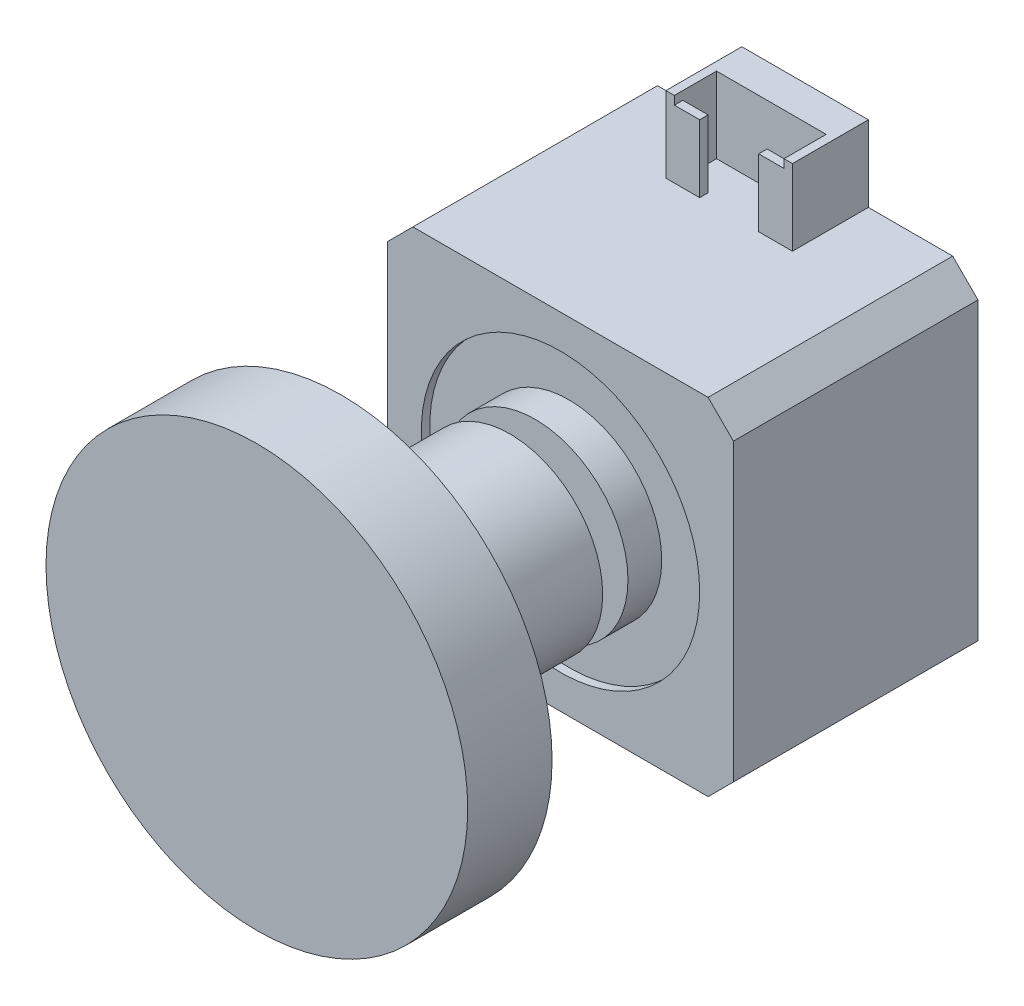
ISO-10303-21;
HEADER;
FILE_DESCRIPTION(('STEP AP214'),'2;1');
FILE_NAME('part.step','',(''),(''),'','','');
FILE_SCHEMA(('AUTOMOTIVE_DESIGN { 1 0 10303 214 1 1 1 1 }'));
ENDSEC;
DATA;
#1=APPLICATION_CONTEXT('core data for automotive mechanical design processes');
#2=APPLICATION_PROTOCOL_DEFINITION('international standard','automotive_design',2000,#1);
#3=PRODUCT_CONTEXT('',#1,'mechanical');
#4=PRODUCT('Part','Part','',(#3));
#5=PRODUCT_RELATED_PRODUCT_CATEGORY('part','',(#4));
#6=PRODUCT_DEFINITION_FORMATION('','',#4);
#7=PRODUCT_DEFINITION_CONTEXT('part definition',#1,'design');
#8=PRODUCT_DEFINITION('design','',#6,#7);
#9=PRODUCT_DEFINITION_SHAPE('','',#8);
#10=(LENGTH_UNIT() NAMED_UNIT(*) SI_UNIT(.MILLI.,.METRE.));
#11=(NAMED_UNIT(*) PLANE_ANGLE_UNIT() SI_UNIT($,.RADIAN.));
#12=(NAMED_UNIT(*) SI_UNIT($,.STERADIAN.) SOLID_ANGLE_UNIT());
#13=UNCERTAINTY_MEASURE_WITH_UNIT(LENGTH_MEASURE(1.E-05),#10,'distance_accuracy_value','');
#14=(GEOMETRIC_REPRESENTATION_CONTEXT(3) GLOBAL_UNCERTAINTY_ASSIGNED_CONTEXT((#13)) GLOBAL_UNIT_ASSIGNED_CONTEXT((#10,
#11,#12)) REPRESENTATION_CONTEXT('',''));
#15=CARTESIAN_POINT('',(0.,0.,0.));
#16=DIRECTION('',(0.,0.,1.));
#17=DIRECTION('',(1.,0.,0.));
#18=AXIS2_PLACEMENT_3D('',#15,#16,#17);
#19=CARTESIAN_POINT('',(0.,50.,0.));
#20=DIRECTION('',(0.,-1.,0.));
#21=DIRECTION('',(0.,0.,-1.));
#22=AXIS2_PLACEMENT_3D('',#19,#20,#21);
#23=PLANE('',#22);
#24=DIRECTION('',(0.,0.,-1.));
#25=VECTOR('',#24,1.);
#26=CARTESIAN_POINT('',(27.,50.,8.));
#27=LINE('',#26,#25);
#28=CARTESIAN_POINT('',(27.,50.,9.));
#29=VERTEX_POINT('',#28);
#30=CARTESIAN_POINT('',(27.,50.,4.));
#31=VERTEX_POINT('',#30);
#32=EDGE_CURVE('E218',#29,#31,#27,.T.);
#33=ORIENTED_EDGE('',*,*,#32,.F.);
#34=DIRECTION('',(1.,0.,0.));
#35=VECTOR('',#34,1.);
#36=CARTESIAN_POINT('',(28.,50.,9.));
#37=LINE('',#36,#35);
#38=CARTESIAN_POINT('',(28.,50.,9.));
#39=VERTEX_POINT('',#38);
#40=EDGE_CURVE('E222',#29,#39,#37,.T.);
#41=ORIENTED_EDGE('',*,*,#40,.T.);
#42=DIRECTION('',(0.,0.,-1.));
#43=VECTOR('',#42,1.);
#44=CARTESIAN_POINT('',(28.,50.,0.));
#45=LINE('',#44,#43);
#46=CARTESIAN_POINT('',(28.,50.,0.));
#47=VERTEX_POINT('',#46);
#48=EDGE_CURVE('E262',#39,#47,#45,.T.);
#49=ORIENTED_EDGE('',*,*,#48,.T.);
#50=DIRECTION('',(-1.,0.,0.));
#51=VECTOR('',#50,1.);
#52=CARTESIAN_POINT('',(28.,50.,0.));
#53=LINE('',#52,#51);
#54=CARTESIAN_POINT('',(13.,50.,0.));
#55=VERTEX_POINT('',#54);
#56=EDGE_CURVE('E248',#47,#55,#53,.T.);
#57=ORIENTED_EDGE('',*,*,#56,.T.);
#58=DIRECTION('',(0.,0.,1.));
#59=VECTOR('',#58,1.);
#60=CARTESIAN_POINT('',(13.,50.,0.));
#61=LINE('',#60,#59);
#62=CARTESIAN_POINT('',(13.,50.,9.));
#63=VERTEX_POINT('',#62);
#64=EDGE_CURVE('E245',#55,#63,#61,.T.);
#65=ORIENTED_EDGE('',*,*,#64,.T.);
#66=CARTESIAN_POINT('',(14.,50.,9.));
#67=VERTEX_POINT('',#66);
#68=EDGE_CURVE('E244',#63,#67,#37,.T.);
#69=ORIENTED_EDGE('',*,*,#68,.T.);
#70=DIRECTION('',(0.,0.,1.));
#71=VECTOR('',#70,1.);
#72=CARTESIAN_POINT('',(14.,50.,8.));
#73=LINE('',#72,#71);
#74=CARTESIAN_POINT('',(14.,50.,4.));
#75=VERTEX_POINT('',#74);
#76=EDGE_CURVE('E391',#75,#67,#73,.T.);
#77=ORIENTED_EDGE('',*,*,#76,.F.);
#78=DIRECTION('',(-1.,0.,0.));
#79=VECTOR('',#78,1.);
#80=CARTESIAN_POINT('',(27.,50.,4.));
#81=LINE('',#80,#79);
#82=EDGE_CURVE('E224',#31,#75,#81,.T.);
#83=ORIENTED_EDGE('',*,*,#82,.F.);
#84=EDGE_LOOP('',(#33,#41,#49,#57,#65,#69,#77,#83));
#85=FACE_BOUND('',#84,.T.);
#86=ADVANCED_FACE('F69',(#85),#23,.F.);
#87=CARTESIAN_POINT('',(28.,50.,9.));
#88=DIRECTION('',(0.,0.,-1.));
#89=DIRECTION('',(-1.,0.,0.));
#90=AXIS2_PLACEMENT_3D('',#87,#88,#89);
#91=PLANE('',#90);
#92=DIRECTION('',(0.,-1.,0.));
#93=VECTOR('',#92,1.);
#94=CARTESIAN_POINT('',(27.,0.,9.));
#95=LINE('',#94,#93);
#96=CARTESIAN_POINT('',(27.,49.,9.));
#97=VERTEX_POINT('',#96);
#98=EDGE_CURVE('E231',#29,#97,#95,.T.);
#99=ORIENTED_EDGE('',*,*,#98,.T.);
#100=DIRECTION('',(1.,0.,0.));
#101=VECTOR('',#100,1.);
#102=CARTESIAN_POINT('',(0.,49.,9.));
#103=LINE('',#102,#101);
#104=CARTESIAN_POINT('',(24.,49.,9.));
#105=VERTEX_POINT('',#104);
#106=EDGE_CURVE('E452',#105,#97,#103,.T.);
#107=ORIENTED_EDGE('',*,*,#106,.F.);
#108=DIRECTION('',(0.,1.,0.));
#109=VECTOR('',#108,1.);
#110=CARTESIAN_POINT('',(24.,0.,9.));
#111=LINE('',#110,#109);
#112=CARTESIAN_POINT('',(24.,41.,9.));
#113=VERTEX_POINT('',#112);
#114=EDGE_CURVE('E444',#113,#105,#111,.T.);
#115=ORIENTED_EDGE('',*,*,#114,.F.);
#116=DIRECTION('',(1.,0.,0.));
#117=VECTOR('',#116,1.);
#118=CARTESIAN_POINT('',(28.,41.,9.));
#119=LINE('',#118,#117);
#120=CARTESIAN_POINT('',(28.,41.,9.));
#121=VERTEX_POINT('',#120);
#122=EDGE_CURVE('E92',#113,#121,#119,.T.);
#123=ORIENTED_EDGE('',*,*,#122,.T.);
#124=DIRECTION('',(0.,-1.,0.));
#125=VECTOR('',#124,1.);
#126=CARTESIAN_POINT('',(28.,50.,9.));
#127=LINE('',#126,#125);
#128=EDGE_CURVE('E242',#39,#121,#127,.T.);
#129=ORIENTED_EDGE('',*,*,#128,.F.);
#130=ORIENTED_EDGE('',*,*,#40,.F.);
#131=EDGE_LOOP('',(#99,#107,#115,#123,#129,#130));
#132=FACE_BOUND('',#131,.T.);
#133=ADVANCED_FACE('F240',(#132),#91,.F.);
#134=DIRECTION('',(0.,1.,0.));
#135=VECTOR('',#134,1.);
#136=CARTESIAN_POINT('',(17.,0.,9.));
#137=LINE('',#136,#135);
#138=CARTESIAN_POINT('',(17.,41.,9.));
#139=VERTEX_POINT('',#138);
#140=CARTESIAN_POINT('',(17.,49.,9.));
#141=VERTEX_POINT('',#140);
#142=EDGE_CURVE('E237',#139,#141,#137,.T.);
#143=ORIENTED_EDGE('',*,*,#142,.T.);
#144=DIRECTION('',(-1.,0.,0.));
#145=VECTOR('',#144,1.);
#146=CARTESIAN_POINT('',(17.,49.,9.));
#147=LINE('',#146,#145);
#148=CARTESIAN_POINT('',(14.,49.,9.));
#149=VERTEX_POINT('',#148);
#150=EDGE_CURVE('E381',#141,#149,#147,.T.);
#151=ORIENTED_EDGE('',*,*,#150,.T.);
#152=DIRECTION('',(0.,-1.,0.));
#153=VECTOR('',#152,1.);
#154=CARTESIAN_POINT('',(14.,50.,9.));
#155=LINE('',#154,#153);
#156=EDGE_CURVE('E379',#67,#149,#155,.T.);
#157=ORIENTED_EDGE('',*,*,#156,.F.);
#158=ORIENTED_EDGE('',*,*,#68,.F.);
#159=DIRECTION('',(0.,-1.,0.));
#160=VECTOR('',#159,1.);
#161=CARTESIAN_POINT('',(13.,50.,9.));
#162=LINE('',#161,#160);
#163=CARTESIAN_POINT('',(13.,41.,9.));
#164=VERTEX_POINT('',#163);
#165=EDGE_CURVE('E264',#63,#164,#162,.T.);
#166=ORIENTED_EDGE('',*,*,#165,.T.);
#167=EDGE_CURVE('E259',#164,#139,#119,.T.);
#168=ORIENTED_EDGE('',*,*,#167,.T.);
#169=EDGE_LOOP('',(#143,#151,#157,#158,#166,#168));
#170=FACE_BOUND('',#169,.T.);
#171=ADVANCED_FACE('F422',(#170),#91,.F.);
#172=CARTESIAN_POINT('',(27.,50.,8.));
#173=DIRECTION('',(0.,0.,-1.));
#174=DIRECTION('',(-1.,0.,0.));
#175=AXIS2_PLACEMENT_3D('',#172,#173,#174);
#176=PLANE('',#175);
#177=DIRECTION('',(1.,0.,0.));
#178=VECTOR('',#177,1.);
#179=CARTESIAN_POINT('',(27.,49.,8.));
#180=LINE('',#179,#178);
#181=CARTESIAN_POINT('',(14.,49.,8.));
#182=VERTEX_POINT('',#181);
#183=CARTESIAN_POINT('',(17.,49.,8.));
#184=VERTEX_POINT('',#183);
#185=EDGE_CURVE('E77',#182,#184,#180,.T.);
#186=ORIENTED_EDGE('',*,*,#185,.T.);
#187=DIRECTION('',(0.,-1.,0.));
#188=VECTOR('',#187,1.);
#189=CARTESIAN_POINT('',(17.,50.,8.));
#190=LINE('',#189,#188);
#191=CARTESIAN_POINT('',(17.,41.,8.));
#192=VERTEX_POINT('',#191);
#193=EDGE_CURVE('E369',#184,#192,#190,.T.);
#194=ORIENTED_EDGE('',*,*,#193,.T.);
#195=DIRECTION('',(1.,0.,0.));
#196=VECTOR('',#195,1.);
#197=CARTESIAN_POINT('',(27.,41.,8.));
#198=LINE('',#197,#196);
#199=CARTESIAN_POINT('',(14.,41.,8.));
#200=VERTEX_POINT('',#199);
#201=EDGE_CURVE('E228',#200,#192,#198,.T.);
#202=ORIENTED_EDGE('',*,*,#201,.F.);
#203=DIRECTION('',(0.,-1.,0.));
#204=VECTOR('',#203,1.);
#205=CARTESIAN_POINT('',(14.,50.,8.));
#206=LINE('',#205,#204);
#207=EDGE_CURVE('E371',#182,#200,#206,.T.);
#208=ORIENTED_EDGE('',*,*,#207,.F.);
#209=EDGE_LOOP('',(#186,#194,#202,#208));
#210=FACE_BOUND('',#209,.T.);
#211=ADVANCED_FACE('F367',(#210),#176,.T.);
#212=CARTESIAN_POINT('',(0.,0.,29.));
#213=DIRECTION('',(1.,0.,0.));
#214=DIRECTION('',(0.,0.,-1.));
#215=AXIS2_PLACEMENT_3D('',#212,#213,#214);
#216=PLANE('',#215);
#217=DIRECTION('',(0.,-1.,0.));
#218=VECTOR('',#217,1.);
#219=CARTESIAN_POINT('',(0.,0.,0.));
#220=LINE('',#219,#218);
#221=CARTESIAN_POINT('',(0.,38.,0.));
#222=VERTEX_POINT('',#221);
#223=CARTESIAN_POINT('',(0.,3.00000000000002,0.));
#224=VERTEX_POINT('',#223);
#225=EDGE_CURVE('E301',#222,#224,#220,.T.);
#226=ORIENTED_EDGE('',*,*,#225,.T.);
#227=DIRECTION('',(0.,0.,1.));
#228=VECTOR('',#227,1.);
#229=CARTESIAN_POINT('',(0.,3.00000000000002,29.));
#230=LINE('',#229,#228);
#231=CARTESIAN_POINT('',(0.,3.00000000000002,29.));
#232=VERTEX_POINT('',#231);
#233=EDGE_CURVE('E362',#224,#232,#230,.T.);
#234=ORIENTED_EDGE('',*,*,#233,.T.);
#235=DIRECTION('',(0.,-1.,0.));
#236=VECTOR('',#235,1.);
#237=CARTESIAN_POINT('',(0.,0.,29.));
#238=LINE('',#237,#236);
#239=CARTESIAN_POINT('',(0.,38.,29.));
#240=VERTEX_POINT('',#239);
#241=EDGE_CURVE('E304',#240,#232,#238,.T.);
#242=ORIENTED_EDGE('',*,*,#241,.F.);
#243=DIRECTION('',(0.,0.,-1.));
#244=VECTOR('',#243,1.);
#245=CARTESIAN_POINT('',(0.,38.,29.));
#246=LINE('',#245,#244);
#247=EDGE_CURVE('E359',#240,#222,#246,.T.);
#248=ORIENTED_EDGE('',*,*,#247,.T.);
#249=EDGE_LOOP('',(#226,#234,#242,#248));
#250=FACE_BOUND('',#249,.T.);
#251=ADVANCED_FACE('F538',(#250),#216,.F.);
#252=CARTESIAN_POINT('',(0.,0.,29.));
#253=DIRECTION('',(0.,1.,0.));
#254=DIRECTION('',(0.,0.,1.));
#255=AXIS2_PLACEMENT_3D('',#252,#253,#254);
#256=PLANE('',#255);
#257=DIRECTION('',(1.,0.,0.));
#258=VECTOR('',#257,1.);
#259=CARTESIAN_POINT('',(0.,0.,0.));
#260=LINE('',#259,#258);
#261=CARTESIAN_POINT('',(3.,0.,0.));
#262=VERTEX_POINT('',#261);
#263=CARTESIAN_POINT('',(38.,0.,0.));
#264=VERTEX_POINT('',#263);
#265=EDGE_CURVE('E320',#262,#264,#260,.T.);
#266=ORIENTED_EDGE('',*,*,#265,.T.);
#267=DIRECTION('',(0.,0.,1.));
#268=VECTOR('',#267,1.);
#269=CARTESIAN_POINT('',(38.,0.,29.));
#270=LINE('',#269,#268);
#271=CARTESIAN_POINT('',(38.,0.,29.));
#272=VERTEX_POINT('',#271);
#273=EDGE_CURVE('E357',#264,#272,#270,.T.);
#274=ORIENTED_EDGE('',*,*,#273,.T.);
#275=DIRECTION('',(1.,0.,0.));
#276=VECTOR('',#275,1.);
#277=CARTESIAN_POINT('',(0.,0.,29.));
#278=LINE('',#277,#276);
#279=CARTESIAN_POINT('',(3.,0.,29.));
#280=VERTEX_POINT('',#279);
#281=EDGE_CURVE('E307',#280,#272,#278,.T.);
#282=ORIENTED_EDGE('',*,*,#281,.F.);
#283=DIRECTION('',(0.,0.,-1.));
#284=VECTOR('',#283,1.);
#285=CARTESIAN_POINT('',(3.,0.,29.));
#286=LINE('',#285,#284);
#287=EDGE_CURVE('E354',#280,#262,#286,.T.);
#288=ORIENTED_EDGE('',*,*,#287,.T.);
#289=EDGE_LOOP('',(#266,#274,#282,#288));
#290=FACE_BOUND('',#289,.T.);
#291=ADVANCED_FACE('F534',(#290),#256,.F.);
#292=CARTESIAN_POINT('',(41.,0.,29.));
#293=DIRECTION('',(-1.,0.,0.));
#294=DIRECTION('',(0.,0.,1.));
#295=AXIS2_PLACEMENT_3D('',#292,#293,#294);
#296=PLANE('',#295);
#297=DIRECTION('',(0.,1.,0.));
#298=VECTOR('',#297,1.);
#299=CARTESIAN_POINT('',(41.,0.,0.));
#300=LINE('',#299,#298);
#301=CARTESIAN_POINT('',(41.,3.,0.));
#302=VERTEX_POINT('',#301);
#303=CARTESIAN_POINT('',(41.,38.,0.));
#304=VERTEX_POINT('',#303);
#305=EDGE_CURVE('E323',#302,#304,#300,.T.);
#306=ORIENTED_EDGE('',*,*,#305,.T.);
#307=DIRECTION('',(0.,0.,1.));
#308=VECTOR('',#307,1.);
#309=CARTESIAN_POINT('',(41.,38.,29.));
#310=LINE('',#309,#308);
#311=CARTESIAN_POINT('',(41.,38.,29.));
#312=VERTEX_POINT('',#311);
#313=EDGE_CURVE('E344',#304,#312,#310,.T.);
#314=ORIENTED_EDGE('',*,*,#313,.T.);
#315=DIRECTION('',(0.,1.,0.));
#316=VECTOR('',#315,1.);
#317=CARTESIAN_POINT('',(41.,0.,29.));
#318=LINE('',#317,#316);
#319=CARTESIAN_POINT('',(41.,3.,29.));
#320=VERTEX_POINT('',#319);
#321=EDGE_CURVE('E311',#320,#312,#318,.T.);
#322=ORIENTED_EDGE('',*,*,#321,.F.);
#323=DIRECTION('',(0.,0.,-1.));
#324=VECTOR('',#323,1.);
#325=CARTESIAN_POINT('',(41.,3.,29.));
#326=LINE('',#325,#324);
#327=EDGE_CURVE('E341',#320,#302,#326,.T.);
#328=ORIENTED_EDGE('',*,*,#327,.T.);
#329=EDGE_LOOP('',(#306,#314,#322,#328));
#330=FACE_BOUND('',#329,.T.);
#331=ADVANCED_FACE('F528',(#330),#296,.F.);
#332=CARTESIAN_POINT('',(0.,0.,29.));
#333=DIRECTION('',(0.,0.,-1.));
#334=DIRECTION('',(-1.,0.,0.));
#335=AXIS2_PLACEMENT_3D('',#332,#333,#334);
#336=PLANE('',#335);
#337=CARTESIAN_POINT('',(20.5,20.5,29.));
#338=DIRECTION('',(0.,0.,1.));
#339=DIRECTION('',(1.,0.,0.));
#340=AXIS2_PLACEMENT_3D('',#337,#338,#339);
#341=CIRCLE('',#340,16.5);
#342=CARTESIAN_POINT('',(37.,20.5,29.));
#343=VERTEX_POINT('',#342);
#344=EDGE_CURVE('E294',#343,#343,#341,.T.);
#345=ORIENTED_EDGE('',*,*,#344,.F.);
#346=EDGE_LOOP('',(#345));
#347=FACE_BOUND('',#346,.T.);
#348=ORIENTED_EDGE('',*,*,#321,.T.);
#349=DIRECTION('',(0.707106781186544,-0.707106781186551,0.));
#350=VECTOR('',#349,1.);
#351=CARTESIAN_POINT('',(38.,41.,29.));
#352=LINE('',#351,#350);
#353=CARTESIAN_POINT('',(38.,41.,29.));
#354=VERTEX_POINT('',#353);
#355=EDGE_CURVE('E352',#312,#354,#352,.F.);
#356=ORIENTED_EDGE('',*,*,#355,.T.);
#357=DIRECTION('',(-1.,0.,0.));
#358=VECTOR('',#357,1.);
#359=CARTESIAN_POINT('',(0.,41.,29.));
#360=LINE('',#359,#358);
#361=CARTESIAN_POINT('',(3.00000000000003,41.,29.));
#362=VERTEX_POINT('',#361);
#363=EDGE_CURVE('E314',#354,#362,#360,.T.);
#364=ORIENTED_EDGE('',*,*,#363,.T.);
#365=DIRECTION('',(0.70710678118655,0.707106781186545,0.));
#366=VECTOR('',#365,1.);
#367=CARTESIAN_POINT('',(0.,38.,29.));
#368=LINE('',#367,#366);
#369=EDGE_CURVE('E346',#362,#240,#368,.F.);
#370=ORIENTED_EDGE('',*,*,#369,.T.);
#371=ORIENTED_EDGE('',*,*,#241,.T.);
#372=DIRECTION('',(-0.707106781186546,0.707106781186549,0.));
#373=VECTOR('',#372,1.);
#374=CARTESIAN_POINT('',(3.,0.,29.));
#375=LINE('',#374,#373);
#376=EDGE_CURVE('E348',#232,#280,#375,.F.);
#377=ORIENTED_EDGE('',*,*,#376,.T.);
#378=ORIENTED_EDGE('',*,*,#281,.T.);
#379=DIRECTION('',(-0.70710678118655,-0.707106781186545,0.));
#380=VECTOR('',#379,1.);
#381=CARTESIAN_POINT('',(41.,3.,29.));
#382=LINE('',#381,#380);
#383=EDGE_CURVE('E350',#272,#320,#382,.F.);
#384=ORIENTED_EDGE('',*,*,#383,.T.);
#385=EDGE_LOOP('',(#348,#356,#364,#370,#371,#377,#378,#384));
#386=FACE_BOUND('',#385,.T.);
#387=ADVANCED_FACE('F525',(#347,#386),#336,.F.);
#388=CARTESIAN_POINT('',(0.,0.,0.));
#389=DIRECTION('',(0.,0.,-1.));
#390=DIRECTION('',(-1.,0.,0.));
#391=AXIS2_PLACEMENT_3D('',#388,#389,#390);
#392=PLANE('',#391);
#393=DIRECTION('',(-1.,0.,0.));
#394=VECTOR('',#393,1.);
#395=CARTESIAN_POINT('',(0.,41.,0.));
#396=LINE('',#395,#394);
#397=CARTESIAN_POINT('',(38.,41.,0.));
#398=VERTEX_POINT('',#397);
#399=CARTESIAN_POINT('',(28.,41.,0.));
#400=VERTEX_POINT('',#399);
#401=EDGE_CURVE('E308',#398,#400,#396,.T.);
#402=ORIENTED_EDGE('',*,*,#401,.F.);
#403=DIRECTION('',(-0.707106781186544,0.707106781186551,0.));
#404=VECTOR('',#403,1.);
#405=CARTESIAN_POINT('',(39.5000000000002,39.4999999999998,0.));
#406=LINE('',#405,#404);
#407=EDGE_CURVE('E339',#398,#304,#406,.F.);
#408=ORIENTED_EDGE('',*,*,#407,.T.);
#409=ORIENTED_EDGE('',*,*,#305,.F.);
#410=DIRECTION('',(0.70710678118655,0.707106781186545,0.));
#411=VECTOR('',#410,1.);
#412=CARTESIAN_POINT('',(18.9999999999998,-19.,0.));
#413=LINE('',#412,#411);
#414=EDGE_CURVE('E337',#302,#264,#413,.F.);
#415=ORIENTED_EDGE('',*,*,#414,.T.);
#416=ORIENTED_EDGE('',*,*,#265,.F.);
#417=DIRECTION('',(0.707106781186546,-0.707106781186549,0.));
#418=VECTOR('',#417,1.);
#419=CARTESIAN_POINT('',(1.50000000000001,1.5,0.));
#420=LINE('',#419,#418);
#421=EDGE_CURVE('E335',#262,#224,#420,.F.);
#422=ORIENTED_EDGE('',*,*,#421,.T.);
#423=ORIENTED_EDGE('',*,*,#225,.F.);
#424=DIRECTION('',(-0.70710678118655,-0.707106781186545,0.));
#425=VECTOR('',#424,1.);
#426=CARTESIAN_POINT('',(-19.,19.0000000000001,0.));
#427=LINE('',#426,#425);
#428=CARTESIAN_POINT('',(3.00000000000003,41.,0.));
#429=VERTEX_POINT('',#428);
#430=EDGE_CURVE('E332',#222,#429,#427,.F.);
#431=ORIENTED_EDGE('',*,*,#430,.T.);
#432=CARTESIAN_POINT('',(13.,41.,0.));
#433=VERTEX_POINT('',#432);
#434=EDGE_CURVE('E326',#433,#429,#396,.T.);
#435=ORIENTED_EDGE('',*,*,#434,.F.);
#436=DIRECTION('',(0.,-1.,0.));
#437=VECTOR('',#436,1.);
#438=CARTESIAN_POINT('',(13.,50.,0.));
#439=LINE('',#438,#437);
#440=EDGE_CURVE('E267',#55,#433,#439,.T.);
#441=ORIENTED_EDGE('',*,*,#440,.F.);
#442=ORIENTED_EDGE('',*,*,#56,.F.);
#443=DIRECTION('',(0.,-1.,0.));
#444=VECTOR('',#443,1.);
#445=CARTESIAN_POINT('',(28.,50.,0.));
#446=LINE('',#445,#444);
#447=EDGE_CURVE('E270',#47,#400,#446,.T.);
#448=ORIENTED_EDGE('',*,*,#447,.T.);
#449=EDGE_LOOP('',(#402,#408,#409,#415,#416,#422,#423,#431,#435,#441,#442,#448));
#450=FACE_BOUND('',#449,.T.);
#451=ADVANCED_FACE('F416',(#450),#392,.T.);
#452=CARTESIAN_POINT('',(20.5,20.5,28.));
#453=DIRECTION('',(0.,0.,1.));
#454=DIRECTION('',(1.,0.,0.));
#455=AXIS2_PLACEMENT_3D('',#452,#453,#454);
#456=CYLINDRICAL_SURFACE('',#455,11.);
#457=CARTESIAN_POINT('',(20.5,20.5,28.));
#458=DIRECTION('',(0.,0.,1.));
#459=DIRECTION('',(1.,0.,0.));
#460=AXIS2_PLACEMENT_3D('',#457,#458,#459);
#461=CIRCLE('',#460,11.);
#462=CARTESIAN_POINT('',(31.5,20.5,28.));
#463=VERTEX_POINT('',#462);
#464=EDGE_CURVE('E295',#463,#463,#461,.T.);
#465=ORIENTED_EDGE('',*,*,#464,.T.);
#466=EDGE_LOOP('',(#465));
#467=FACE_BOUND('',#466,.T.);
#468=CARTESIAN_POINT('',(20.5,20.5,32.));
#469=DIRECTION('',(0.,0.,1.));
#470=DIRECTION('',(1.,0.,0.));
#471=AXIS2_PLACEMENT_3D('',#468,#469,#470);
#472=CIRCLE('',#471,11.);
#473=CARTESIAN_POINT('',(31.5,20.5,32.));
#474=VERTEX_POINT('',#473);
#475=EDGE_CURVE('E291',#474,#474,#472,.T.);
#476=ORIENTED_EDGE('',*,*,#475,.F.);
#477=EDGE_LOOP('',(#476));
#478=FACE_BOUND('',#477,.T.);
#479=ADVANCED_FACE('F520',(#467,#478),#456,.T.);
#480=CARTESIAN_POINT('',(20.5,20.5,28.));
#481=DIRECTION('',(0.,0.,1.));
#482=DIRECTION('',(1.,0.,0.));
#483=AXIS2_PLACEMENT_3D('',#480,#481,#482);
#484=CYLINDRICAL_SURFACE('',#483,16.5);
#485=CARTESIAN_POINT('',(20.5,20.5,28.));
#486=DIRECTION('',(0.,0.,1.));
#487=DIRECTION('',(1.,0.,0.));
#488=AXIS2_PLACEMENT_3D('',#485,#486,#487);
#489=CIRCLE('',#488,16.5);
#490=CARTESIAN_POINT('',(37.,20.5,28.));
#491=VERTEX_POINT('',#490);
#492=EDGE_CURVE('E298',#491,#491,#489,.T.);
#493=ORIENTED_EDGE('',*,*,#492,.F.);
#494=EDGE_LOOP('',(#493));
#495=FACE_BOUND('',#494,.T.);
#496=ORIENTED_EDGE('',*,*,#344,.T.);
#497=EDGE_LOOP('',(#496));
#498=FACE_BOUND('',#497,.T.);
#499=ADVANCED_FACE('F516',(#495,#498),#484,.F.);
#500=CARTESIAN_POINT('',(0.,0.,28.));
#501=DIRECTION('',(0.,0.,1.));
#502=DIRECTION('',(1.,0.,0.));
#503=AXIS2_PLACEMENT_3D('',#500,#501,#502);
#504=PLANE('',#503);
#505=ORIENTED_EDGE('',*,*,#464,.F.);
#506=EDGE_LOOP('',(#505));
#507=FACE_BOUND('',#506,.T.);
#508=ORIENTED_EDGE('',*,*,#492,.T.);
#509=EDGE_LOOP('',(#508));
#510=FACE_BOUND('',#509,.T.);
#511=ADVANCED_FACE('F512',(#507,#510),#504,.T.);
#512=CARTESIAN_POINT('',(0.,0.,32.));
#513=DIRECTION('',(0.,0.,1.));
#514=DIRECTION('',(1.,0.,0.));
#515=AXIS2_PLACEMENT_3D('',#512,#513,#514);
#516=PLANE('',#515);
#517=CARTESIAN_POINT('',(20.5,20.5,32.));
#518=DIRECTION('',(0.,0.,1.));
#519=DIRECTION('',(1.,0.,0.));
#520=AXIS2_PLACEMENT_3D('',#517,#518,#519);
#521=CIRCLE('',#520,2.49999999999999);
#522=CARTESIAN_POINT('',(23.,20.5,32.));
#523=VERTEX_POINT('',#522);
#524=EDGE_CURVE('E288',#523,#523,#521,.T.);
#525=ORIENTED_EDGE('',*,*,#524,.F.);
#526=EDGE_LOOP('',(#525));
#527=FACE_BOUND('',#526,.T.);
#528=ORIENTED_EDGE('',*,*,#475,.T.);
#529=EDGE_LOOP('',(#528));
#530=FACE_BOUND('',#529,.T.);
#531=ADVANCED_FACE('F508',(#527,#530),#516,.T.);
#532=CARTESIAN_POINT('',(20.5,20.5,35.));
#533=DIRECTION('',(0.,0.,-1.));
#534=DIRECTION('',(-1.,0.,0.));
#535=AXIS2_PLACEMENT_3D('',#532,#533,#534);
#536=CYLINDRICAL_SURFACE('',#535,2.49999999999999);
#537=ORIENTED_EDGE('',*,*,#524,.T.);
#538=EDGE_LOOP('',(#537));
#539=FACE_BOUND('',#538,.T.);
#540=CARTESIAN_POINT('',(20.5,20.5,35.));
#541=DIRECTION('',(0.,0.,1.));
#542=DIRECTION('',(1.,0.,0.));
#543=AXIS2_PLACEMENT_3D('',#540,#541,#542);
#544=CIRCLE('',#543,2.49999999999999);
#545=CARTESIAN_POINT('',(23.,20.5,35.));
#546=VERTEX_POINT('',#545);
#547=EDGE_CURVE('E283',#546,#546,#544,.T.);
#548=ORIENTED_EDGE('',*,*,#547,.F.);
#549=EDGE_LOOP('',(#548));
#550=FACE_BOUND('',#549,.T.);
#551=ADVANCED_FACE('F504',(#539,#550),#536,.T.);
#552=CARTESIAN_POINT('',(20.5,20.5,55.));
#553=DIRECTION('',(0.,0.,-1.));
#554=DIRECTION('',(-1.,0.,0.));
#555=AXIS2_PLACEMENT_3D('',#552,#553,#554);
#556=CYLINDRICAL_SURFACE('',#555,11.);
#557=CARTESIAN_POINT('',(20.5,20.5,55.));
#558=DIRECTION('',(0.,0.,1.));
#559=DIRECTION('',(1.,0.,0.));
#560=AXIS2_PLACEMENT_3D('',#557,#558,#559);
#561=CIRCLE('',#560,11.);
#562=CARTESIAN_POINT('',(31.5,20.5,55.));
#563=VERTEX_POINT('',#562);
#564=EDGE_CURVE('E280',#563,#563,#561,.T.);
#565=ORIENTED_EDGE('',*,*,#564,.F.);
#566=EDGE_LOOP('',(#565));
#567=FACE_BOUND('',#566,.T.);
#568=CARTESIAN_POINT('',(20.5,20.5,35.));
#569=DIRECTION('',(0.,0.,1.));
#570=DIRECTION('',(1.,0.,0.));
#571=AXIS2_PLACEMENT_3D('',#568,#569,#570);
#572=CIRCLE('',#571,11.);
#573=CARTESIAN_POINT('',(31.5,20.5,35.));
#574=VERTEX_POINT('',#573);
#575=EDGE_CURVE('E277',#574,#574,#572,.T.);
#576=ORIENTED_EDGE('',*,*,#575,.T.);
#577=EDGE_LOOP('',(#576));
#578=FACE_BOUND('',#577,.T.);
#579=ADVANCED_FACE('F500',(#567,#578),#556,.T.);
#580=CARTESIAN_POINT('',(20.5,20.5,35.));
#581=DIRECTION('',(0.,0.,1.));
#582=DIRECTION('',(1.,0.,0.));
#583=AXIS2_PLACEMENT_3D('',#580,#581,#582);
#584=PLANE('',#583);
#585=ORIENTED_EDGE('',*,*,#547,.T.);
#586=EDGE_LOOP('',(#585));
#587=FACE_BOUND('',#586,.T.);
#588=ORIENTED_EDGE('',*,*,#575,.F.);
#589=EDGE_LOOP('',(#588));
#590=FACE_BOUND('',#589,.T.);
#591=ADVANCED_FACE('F496',(#587,#590),#584,.F.);
#592=CARTESIAN_POINT('',(20.5,20.5,65.));
#593=DIRECTION('',(0.,0.,-1.));
#594=DIRECTION('',(-1.,0.,0.));
#595=AXIS2_PLACEMENT_3D('',#592,#593,#594);
#596=CYLINDRICAL_SURFACE('',#595,25.);
#597=CARTESIAN_POINT('',(20.5,20.5,65.));
#598=DIRECTION('',(0.,0.,1.));
#599=DIRECTION('',(1.,0.,0.));
#600=AXIS2_PLACEMENT_3D('',#597,#598,#599);
#601=CIRCLE('',#600,25.);
#602=CARTESIAN_POINT('',(45.5,20.5,65.));
#603=VERTEX_POINT('',#602);
#604=EDGE_CURVE('E274',#603,#603,#601,.T.);
#605=ORIENTED_EDGE('',*,*,#604,.F.);
#606=EDGE_LOOP('',(#605));
#607=FACE_BOUND('',#606,.T.);
#608=CARTESIAN_POINT('',(20.5,20.5,55.));
#609=DIRECTION('',(0.,0.,1.));
#610=DIRECTION('',(1.,0.,0.));
#611=AXIS2_PLACEMENT_3D('',#608,#609,#610);
#612=CIRCLE('',#611,25.);
#613=CARTESIAN_POINT('',(45.5,20.5,55.));
#614=VERTEX_POINT('',#613);
#615=EDGE_CURVE('E273',#614,#614,#612,.T.);
#616=ORIENTED_EDGE('',*,*,#615,.T.);
#617=EDGE_LOOP('',(#616));
#618=FACE_BOUND('',#617,.T.);
#619=ADVANCED_FACE('F488',(#607,#618),#596,.T.);
#620=CARTESIAN_POINT('',(20.5,20.5,65.));
#621=DIRECTION('',(0.,0.,1.));
#622=DIRECTION('',(1.,0.,0.));
#623=AXIS2_PLACEMENT_3D('',#620,#621,#622);
#624=PLANE('',#623);
#625=ORIENTED_EDGE('',*,*,#604,.T.);
#626=EDGE_LOOP('',(#625));
#627=FACE_BOUND('',#626,.T.);
#628=ADVANCED_FACE('F484',(#627),#624,.T.);
#629=CARTESIAN_POINT('',(20.5,20.5,55.));
#630=DIRECTION('',(0.,0.,1.));
#631=DIRECTION('',(1.,0.,0.));
#632=AXIS2_PLACEMENT_3D('',#629,#630,#631);
#633=PLANE('',#632);
#634=ORIENTED_EDGE('',*,*,#564,.T.);
#635=EDGE_LOOP('',(#634));
#636=FACE_BOUND('',#635,.T.);
#637=ORIENTED_EDGE('',*,*,#615,.F.);
#638=EDGE_LOOP('',(#637));
#639=FACE_BOUND('',#638,.T.);
#640=ADVANCED_FACE('F487',(#636,#639),#633,.F.);
#641=CARTESIAN_POINT('',(38.,41.,29.));
#642=DIRECTION('',(-0.707106781186551,-0.707106781186544,0.));
#643=DIRECTION('',(0.,0.,-1.));
#644=AXIS2_PLACEMENT_3D('',#641,#642,#643);
#645=PLANE('',#644);
#646=ORIENTED_EDGE('',*,*,#355,.F.);
#647=ORIENTED_EDGE('',*,*,#313,.F.);
#648=ORIENTED_EDGE('',*,*,#407,.F.);
#649=DIRECTION('',(0.,0.,-1.));
#650=VECTOR('',#649,1.);
#651=CARTESIAN_POINT('',(38.,41.,29.));
#652=LINE('',#651,#650);
#653=EDGE_CURVE('E329',#354,#398,#652,.T.);
#654=ORIENTED_EDGE('',*,*,#653,.F.);
#655=EDGE_LOOP('',(#646,#647,#648,#654));
#656=FACE_BOUND('',#655,.T.);
#657=ADVANCED_FACE('F492',(#656),#645,.F.);
#658=CARTESIAN_POINT('',(41.,3.,29.));
#659=DIRECTION('',(-0.707106781186545,0.70710678118655,0.));
#660=DIRECTION('',(0.,0.,-1.));
#661=AXIS2_PLACEMENT_3D('',#658,#659,#660);
#662=PLANE('',#661);
#663=ORIENTED_EDGE('',*,*,#383,.F.);
#664=ORIENTED_EDGE('',*,*,#273,.F.);
#665=ORIENTED_EDGE('',*,*,#414,.F.);
#666=ORIENTED_EDGE('',*,*,#327,.F.);
#667=EDGE_LOOP('',(#663,#664,#665,#666));
#668=FACE_BOUND('',#667,.T.);
#669=ADVANCED_FACE('F545',(#668),#662,.F.);
#670=CARTESIAN_POINT('',(3.,0.,29.));
#671=DIRECTION('',(0.707106781186549,0.707106781186546,0.));
#672=DIRECTION('',(0.,0.,-1.));
#673=AXIS2_PLACEMENT_3D('',#670,#671,#672);
#674=PLANE('',#673);
#675=ORIENTED_EDGE('',*,*,#376,.F.);
#676=ORIENTED_EDGE('',*,*,#233,.F.);
#677=ORIENTED_EDGE('',*,*,#421,.F.);
#678=ORIENTED_EDGE('',*,*,#287,.F.);
#679=EDGE_LOOP('',(#675,#676,#677,#678));
#680=FACE_BOUND('',#679,.T.);
#681=ADVANCED_FACE('F548',(#680),#674,.F.);
#682=CARTESIAN_POINT('',(0.,38.,29.));
#683=DIRECTION('',(0.707106781186545,-0.70710678118655,0.));
#684=DIRECTION('',(0.,0.,-1.));
#685=AXIS2_PLACEMENT_3D('',#682,#683,#684);
#686=PLANE('',#685);
#687=ORIENTED_EDGE('',*,*,#369,.F.);
#688=DIRECTION('',(0.,0.,1.));
#689=VECTOR('',#688,1.);
#690=CARTESIAN_POINT('',(3.00000000000003,41.,29.));
#691=LINE('',#690,#689);
#692=EDGE_CURVE('E317',#429,#362,#691,.T.);
#693=ORIENTED_EDGE('',*,*,#692,.F.);
#694=ORIENTED_EDGE('',*,*,#430,.F.);
#695=ORIENTED_EDGE('',*,*,#247,.F.);
#696=EDGE_LOOP('',(#687,#693,#694,#695));
#697=FACE_BOUND('',#696,.T.);
#698=ADVANCED_FACE('F71',(#697),#686,.F.);
#699=CARTESIAN_POINT('',(28.,50.,0.));
#700=DIRECTION('',(-1.,0.,0.));
#701=DIRECTION('',(0.,0.,1.));
#702=AXIS2_PLACEMENT_3D('',#699,#700,#701);
#703=PLANE('',#702);
#704=DIRECTION('',(0.,0.,-1.));
#705=VECTOR('',#704,1.);
#706=CARTESIAN_POINT('',(28.,41.,0.));
#707=LINE('',#706,#705);
#708=EDGE_CURVE('E252',#121,#400,#707,.T.);
#709=ORIENTED_EDGE('',*,*,#708,.T.);
#710=ORIENTED_EDGE('',*,*,#447,.F.);
#711=ORIENTED_EDGE('',*,*,#48,.F.);
#712=ORIENTED_EDGE('',*,*,#128,.T.);
#713=EDGE_LOOP('',(#709,#710,#711,#712));
#714=FACE_BOUND('',#713,.T.);
#715=ADVANCED_FACE('F480',(#714),#703,.F.);
#716=CARTESIAN_POINT('',(13.,50.,0.));
#717=DIRECTION('',(1.,0.,0.));
#718=DIRECTION('',(0.,0.,-1.));
#719=AXIS2_PLACEMENT_3D('',#716,#717,#718);
#720=PLANE('',#719);
#721=DIRECTION('',(0.,0.,1.));
#722=VECTOR('',#721,1.);
#723=CARTESIAN_POINT('',(13.,41.,0.));
#724=LINE('',#723,#722);
#725=EDGE_CURVE('E255',#433,#164,#724,.T.);
#726=ORIENTED_EDGE('',*,*,#725,.T.);
#727=ORIENTED_EDGE('',*,*,#165,.F.);
#728=ORIENTED_EDGE('',*,*,#64,.F.);
#729=ORIENTED_EDGE('',*,*,#440,.T.);
#730=EDGE_LOOP('',(#726,#727,#728,#729));
#731=FACE_BOUND('',#730,.T.);
#732=ADVANCED_FACE('F418',(#731),#720,.F.);
#733=CARTESIAN_POINT('',(27.,50.,8.));
#734=DIRECTION('',(-1.,0.,0.));
#735=DIRECTION('',(0.,0.,1.));
#736=AXIS2_PLACEMENT_3D('',#733,#734,#735);
#737=PLANE('',#736);
#738=DIRECTION('',(0.,-1.,0.));
#739=VECTOR('',#738,1.);
#740=CARTESIAN_POINT('',(27.,50.,8.));
#741=LINE('',#740,#739);
#742=CARTESIAN_POINT('',(27.,49.,8.));
#743=VERTEX_POINT('',#742);
#744=CARTESIAN_POINT('',(27.,41.,8.));
#745=VERTEX_POINT('',#744);
#746=EDGE_CURVE('E393',#743,#745,#741,.T.);
#747=ORIENTED_EDGE('',*,*,#746,.F.);
#748=DIRECTION('',(0.,0.,1.));
#749=VECTOR('',#748,1.);
#750=CARTESIAN_POINT('',(27.,49.,7.));
#751=LINE('',#750,#749);
#752=EDGE_CURVE('E234',#743,#97,#751,.T.);
#753=ORIENTED_EDGE('',*,*,#752,.T.);
#754=ORIENTED_EDGE('',*,*,#98,.F.);
#755=ORIENTED_EDGE('',*,*,#32,.T.);
#756=DIRECTION('',(0.,-1.,0.));
#757=VECTOR('',#756,1.);
#758=CARTESIAN_POINT('',(27.,50.,4.));
#759=LINE('',#758,#757);
#760=CARTESIAN_POINT('',(27.,41.,4.));
#761=VERTEX_POINT('',#760);
#762=EDGE_CURVE('E256',#31,#761,#759,.T.);
#763=ORIENTED_EDGE('',*,*,#762,.T.);
#764=DIRECTION('',(0.,0.,-1.));
#765=VECTOR('',#764,1.);
#766=CARTESIAN_POINT('',(27.,41.,8.));
#767=LINE('',#766,#765);
#768=EDGE_CURVE('E388',#745,#761,#767,.T.);
#769=ORIENTED_EDGE('',*,*,#768,.F.);
#770=EDGE_LOOP('',(#747,#753,#754,#755,#763,#769));
#771=FACE_BOUND('',#770,.T.);
#772=ADVANCED_FACE('F233',(#771),#737,.T.);
#773=CARTESIAN_POINT('',(27.,50.,4.));
#774=DIRECTION('',(0.,0.,1.));
#775=DIRECTION('',(1.,0.,0.));
#776=AXIS2_PLACEMENT_3D('',#773,#774,#775);
#777=PLANE('',#776);
#778=DIRECTION('',(-1.,0.,0.));
#779=VECTOR('',#778,1.);
#780=CARTESIAN_POINT('',(27.,41.,4.));
#781=LINE('',#780,#779);
#782=CARTESIAN_POINT('',(14.,41.,4.));
#783=VERTEX_POINT('',#782);
#784=EDGE_CURVE('E396',#761,#783,#781,.T.);
#785=ORIENTED_EDGE('',*,*,#784,.F.);
#786=ORIENTED_EDGE('',*,*,#762,.F.);
#787=ORIENTED_EDGE('',*,*,#82,.T.);
#788=DIRECTION('',(0.,-1.,0.));
#789=VECTOR('',#788,1.);
#790=CARTESIAN_POINT('',(14.,50.,4.));
#791=LINE('',#790,#789);
#792=EDGE_CURVE('E406',#75,#783,#791,.T.);
#793=ORIENTED_EDGE('',*,*,#792,.T.);
#794=EDGE_LOOP('',(#785,#786,#787,#793));
#795=FACE_BOUND('',#794,.T.);
#796=ADVANCED_FACE('F425',(#795),#777,.T.);
#797=CARTESIAN_POINT('',(14.,50.,8.));
#798=DIRECTION('',(1.,0.,0.));
#799=DIRECTION('',(0.,0.,-1.));
#800=AXIS2_PLACEMENT_3D('',#797,#798,#799);
#801=PLANE('',#800);
#802=ORIENTED_EDGE('',*,*,#76,.T.);
#803=ORIENTED_EDGE('',*,*,#156,.T.);
#804=DIRECTION('',(0.,0.,1.));
#805=VECTOR('',#804,1.);
#806=CARTESIAN_POINT('',(14.,49.,7.));
#807=LINE('',#806,#805);
#808=EDGE_CURVE('E238',#182,#149,#807,.T.);
#809=ORIENTED_EDGE('',*,*,#808,.F.);
#810=ORIENTED_EDGE('',*,*,#207,.T.);
#811=DIRECTION('',(0.,0.,1.));
#812=VECTOR('',#811,1.);
#813=CARTESIAN_POINT('',(14.,41.,8.));
#814=LINE('',#813,#812);
#815=EDGE_CURVE('E399',#783,#200,#814,.T.);
#816=ORIENTED_EDGE('',*,*,#815,.F.);
#817=ORIENTED_EDGE('',*,*,#792,.F.);
#818=EDGE_LOOP('',(#802,#803,#809,#810,#816,#817));
#819=FACE_BOUND('',#818,.T.);
#820=ADVANCED_FACE('F376',(#819),#801,.T.);
#821=DIRECTION('',(-1.,0.,0.));
#822=VECTOR('',#821,1.);
#823=CARTESIAN_POINT('',(27.,49.,8.));
#824=LINE('',#823,#822);
#825=CARTESIAN_POINT('',(24.,49.,8.));
#826=VERTEX_POINT('',#825);
#827=EDGE_CURVE('E12',#743,#826,#824,.T.);
#828=ORIENTED_EDGE('',*,*,#827,.F.);
#829=ORIENTED_EDGE('',*,*,#746,.T.);
#830=CARTESIAN_POINT('',(24.,41.,8.));
#831=VERTEX_POINT('',#830);
#832=EDGE_CURVE('E402',#831,#745,#198,.T.);
#833=ORIENTED_EDGE('',*,*,#832,.F.);
#834=DIRECTION('',(0.,-1.,0.));
#835=VECTOR('',#834,1.);
#836=CARTESIAN_POINT('',(24.,50.,8.));
#837=LINE('',#836,#835);
#838=EDGE_CURVE('E386',#826,#831,#837,.T.);
#839=ORIENTED_EDGE('',*,*,#838,.F.);
#840=EDGE_LOOP('',(#828,#829,#833,#839));
#841=FACE_BOUND('',#840,.T.);
#842=ADVANCED_FACE('F436',(#841),#176,.T.);
#843=CARTESIAN_POINT('',(0.,41.,29.));
#844=DIRECTION('',(0.,-1.,0.));
#845=DIRECTION('',(0.,0.,-1.));
#846=AXIS2_PLACEMENT_3D('',#843,#844,#845);
#847=PLANE('',#846);
#848=ORIENTED_EDGE('',*,*,#201,.T.);
#849=DIRECTION('',(0.,0.,1.));
#850=VECTOR('',#849,1.);
#851=CARTESIAN_POINT('',(17.,41.,7.));
#852=LINE('',#851,#850);
#853=EDGE_CURVE('E447',#192,#139,#852,.T.);
#854=ORIENTED_EDGE('',*,*,#853,.T.);
#855=ORIENTED_EDGE('',*,*,#167,.F.);
#856=ORIENTED_EDGE('',*,*,#725,.F.);
#857=ORIENTED_EDGE('',*,*,#434,.T.);
#858=ORIENTED_EDGE('',*,*,#692,.T.);
#859=ORIENTED_EDGE('',*,*,#363,.F.);
#860=ORIENTED_EDGE('',*,*,#653,.T.);
#861=ORIENTED_EDGE('',*,*,#401,.T.);
#862=ORIENTED_EDGE('',*,*,#708,.F.);
#863=ORIENTED_EDGE('',*,*,#122,.F.);
#864=DIRECTION('',(0.,0.,1.));
#865=VECTOR('',#864,1.);
#866=CARTESIAN_POINT('',(24.,41.,7.));
#867=LINE('',#866,#865);
#868=EDGE_CURVE('E432',#831,#113,#867,.T.);
#869=ORIENTED_EDGE('',*,*,#868,.F.);
#870=ORIENTED_EDGE('',*,*,#832,.T.);
#871=ORIENTED_EDGE('',*,*,#768,.T.);
#872=ORIENTED_EDGE('',*,*,#784,.T.);
#873=ORIENTED_EDGE('',*,*,#815,.T.);
#874=EDGE_LOOP('',(#848,#854,#855,#856,#857,#858,#859,#860,#861,#862,#863,#869,#870,#871,#872,#873));
#875=FACE_BOUND('',#874,.T.);
#876=ADVANCED_FACE('F429',(#875),#847,.F.);
#877=CARTESIAN_POINT('',(17.,0.,7.));
#878=DIRECTION('',(1.,0.,0.));
#879=DIRECTION('',(0.,0.,-1.));
#880=AXIS2_PLACEMENT_3D('',#877,#878,#879);
#881=PLANE('',#880);
#882=DIRECTION('',(0.,0.,1.));
#883=VECTOR('',#882,1.);
#884=CARTESIAN_POINT('',(17.,49.,7.));
#885=LINE('',#884,#883);
#886=EDGE_CURVE('E84',#184,#141,#885,.T.);
#887=ORIENTED_EDGE('',*,*,#886,.T.);
#888=ORIENTED_EDGE('',*,*,#142,.F.);
#889=ORIENTED_EDGE('',*,*,#853,.F.);
#890=ORIENTED_EDGE('',*,*,#193,.F.);
#891=EDGE_LOOP('',(#887,#888,#889,#890));
#892=FACE_BOUND('',#891,.T.);
#893=ADVANCED_FACE('F457',(#892),#881,.T.);
#894=CARTESIAN_POINT('',(0.,49.,7.));
#895=DIRECTION('',(0.,-1.,0.));
#896=DIRECTION('',(0.,0.,-1.));
#897=AXIS2_PLACEMENT_3D('',#894,#895,#896);
#898=PLANE('',#897);
#899=ORIENTED_EDGE('',*,*,#827,.T.);
#900=DIRECTION('',(0.,0.,1.));
#901=VECTOR('',#900,1.);
#902=CARTESIAN_POINT('',(24.,49.,7.));
#903=LINE('',#902,#901);
#904=EDGE_CURVE('E440',#826,#105,#903,.T.);
#905=ORIENTED_EDGE('',*,*,#904,.T.);
#906=ORIENTED_EDGE('',*,*,#106,.T.);
#907=ORIENTED_EDGE('',*,*,#752,.F.);
#908=EDGE_LOOP('',(#899,#905,#906,#907));
#909=FACE_BOUND('',#908,.T.);
#910=ADVANCED_FACE('F439',(#909),#898,.F.);
#911=CARTESIAN_POINT('',(24.,0.,7.));
#912=DIRECTION('',(1.,0.,0.));
#913=DIRECTION('',(0.,0.,-1.));
#914=AXIS2_PLACEMENT_3D('',#911,#912,#913);
#915=PLANE('',#914);
#916=ORIENTED_EDGE('',*,*,#838,.T.);
#917=ORIENTED_EDGE('',*,*,#868,.T.);
#918=ORIENTED_EDGE('',*,*,#114,.T.);
#919=ORIENTED_EDGE('',*,*,#904,.F.);
#920=EDGE_LOOP('',(#916,#917,#918,#919));
#921=FACE_BOUND('',#920,.T.);
#922=ADVANCED_FACE('F443',(#921),#915,.F.);
#923=CARTESIAN_POINT('',(17.,49.,7.));
#924=DIRECTION('',(0.,1.,0.));
#925=DIRECTION('',(0.,0.,1.));
#926=AXIS2_PLACEMENT_3D('',#923,#924,#925);
#927=PLANE('',#926);
#928=ORIENTED_EDGE('',*,*,#808,.T.);
#929=ORIENTED_EDGE('',*,*,#150,.F.);
#930=ORIENTED_EDGE('',*,*,#886,.F.);
#931=ORIENTED_EDGE('',*,*,#185,.F.);
#932=EDGE_LOOP('',(#928,#929,#930,#931));
#933=FACE_BOUND('',#932,.T.);
#934=ADVANCED_FACE('F373',(#933),#927,.T.);
#935=CLOSED_SHELL('',(#86,#133,#171,#211,#251,#291,#331,#387,#451,#479,#499,#511,#531,#551,#579,
#591,#619,#628,#640,#657,#669,#681,#698,#715,#732,#772,#796,#820,#842,#876,#893,#910,#922,#934));
#936=MANIFOLD_SOLID_BREP('B2',#935);
#937=ADVANCED_BREP_SHAPE_REPRESENTATION('',(#18,#936),#14);
#938=SHAPE_DEFINITION_REPRESENTATION(#9,#937);
ENDSEC;
END-ISO-10303-21;
